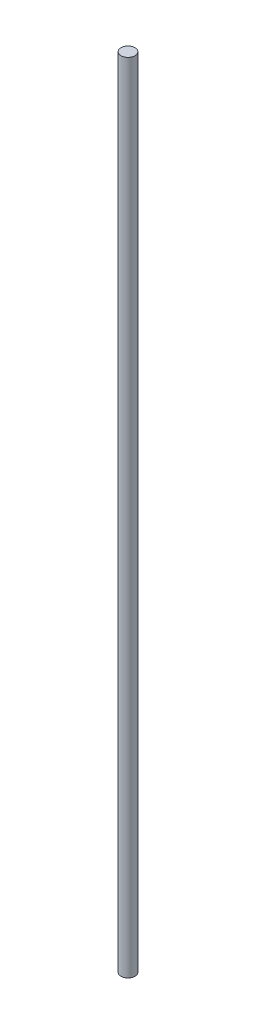
ISO-10303-21;
HEADER;
FILE_DESCRIPTION(('STEP AP214'),'2;1');
FILE_NAME('part.step','',(''),(''),'','','');
FILE_SCHEMA(('AUTOMOTIVE_DESIGN { 1 0 10303 214 1 1 1 1 }'));
ENDSEC;
DATA;
#1=APPLICATION_CONTEXT('core data for automotive mechanical design processes');
#2=APPLICATION_PROTOCOL_DEFINITION('international standard','automotive_design',2000,#1);
#3=PRODUCT_CONTEXT('',#1,'mechanical');
#4=PRODUCT('Part','Part','',(#3));
#5=PRODUCT_RELATED_PRODUCT_CATEGORY('part','',(#4));
#6=PRODUCT_DEFINITION_FORMATION('','',#4);
#7=PRODUCT_DEFINITION_CONTEXT('part definition',#1,'design');
#8=PRODUCT_DEFINITION('design','',#6,#7);
#9=PRODUCT_DEFINITION_SHAPE('','',#8);
#10=(LENGTH_UNIT() NAMED_UNIT(*) SI_UNIT(.MILLI.,.METRE.));
#11=(NAMED_UNIT(*) PLANE_ANGLE_UNIT() SI_UNIT($,.RADIAN.));
#12=(NAMED_UNIT(*) SI_UNIT($,.STERADIAN.) SOLID_ANGLE_UNIT());
#13=UNCERTAINTY_MEASURE_WITH_UNIT(LENGTH_MEASURE(1.E-05),#10,'distance_accuracy_value','');
#14=(GEOMETRIC_REPRESENTATION_CONTEXT(3) GLOBAL_UNCERTAINTY_ASSIGNED_CONTEXT((#13)) GLOBAL_UNIT_ASSIGNED_CONTEXT((#10,
#11,#12)) REPRESENTATION_CONTEXT('',''));
#15=CARTESIAN_POINT('',(0.,0.,0.));
#16=DIRECTION('',(0.,0.,1.));
#17=DIRECTION('',(1.,0.,0.));
#18=AXIS2_PLACEMENT_3D('',#15,#16,#17);
#19=CARTESIAN_POINT('',(0.,100.,0.));
#20=DIRECTION('',(0.,1.,0.));
#21=DIRECTION('',(0.,0.,1.));
#22=AXIS2_PLACEMENT_3D('',#19,#20,#21);
#23=PLANE('',#22);
#24=CARTESIAN_POINT('',(0.,100.,0.));
#25=DIRECTION('',(0.,-1.,0.));
#26=DIRECTION('',(0.,0.,-1.));
#27=AXIS2_PLACEMENT_3D('',#24,#25,#26);
#28=CIRCLE('',#27,0.875000000000001);
#29=CARTESIAN_POINT('',(0.,100.,-0.875000000000001));
#30=VERTEX_POINT('',#29);
#31=EDGE_CURVE('E18',#30,#30,#28,.T.);
#32=ORIENTED_EDGE('',*,*,#31,.F.);
#33=EDGE_LOOP('',(#32));
#34=FACE_BOUND('',#33,.T.);
#35=ADVANCED_FACE('F15',(#34),#23,.T.);
#36=CARTESIAN_POINT('',(0.,0.,0.));
#37=DIRECTION('',(0.,1.,0.));
#38=DIRECTION('',(0.,0.,1.));
#39=AXIS2_PLACEMENT_3D('',#36,#37,#38);
#40=PLANE('',#39);
#41=CARTESIAN_POINT('',(0.,0.,0.));
#42=DIRECTION('',(0.,-1.,0.));
#43=DIRECTION('',(0.,0.,-1.));
#44=AXIS2_PLACEMENT_3D('',#41,#42,#43);
#45=CIRCLE('',#44,0.875000000000001);
#46=CARTESIAN_POINT('',(0.,0.,-0.875000000000001));
#47=VERTEX_POINT('',#46);
#48=EDGE_CURVE('E10',#47,#47,#45,.F.);
#49=ORIENTED_EDGE('',*,*,#48,.F.);
#50=EDGE_LOOP('',(#49));
#51=FACE_BOUND('',#50,.T.);
#52=ADVANCED_FACE('F30',(#51),#40,.F.);
#53=CARTESIAN_POINT('',(0.,100.,0.));
#54=DIRECTION('',(0.,-1.,0.));
#55=DIRECTION('',(0.,0.,-1.));
#56=AXIS2_PLACEMENT_3D('',#53,#54,#55);
#57=CYLINDRICAL_SURFACE('',#56,0.875000000000001);
#58=ORIENTED_EDGE('',*,*,#48,.T.);
#59=EDGE_LOOP('',(#58));
#60=FACE_BOUND('',#59,.T.);
#61=ORIENTED_EDGE('',*,*,#31,.T.);
#62=EDGE_LOOP('',(#61));
#63=FACE_BOUND('',#62,.T.);
#64=ADVANCED_FACE('F27',(#60,#63),#57,.T.);
#65=CLOSED_SHELL('',(#35,#52,#64));
#66=MANIFOLD_SOLID_BREP('B1',#65);
#67=ADVANCED_BREP_SHAPE_REPRESENTATION('',(#18,#66),#14);
#68=SHAPE_DEFINITION_REPRESENTATION(#9,#67);
ENDSEC;
END-ISO-10303-21;
